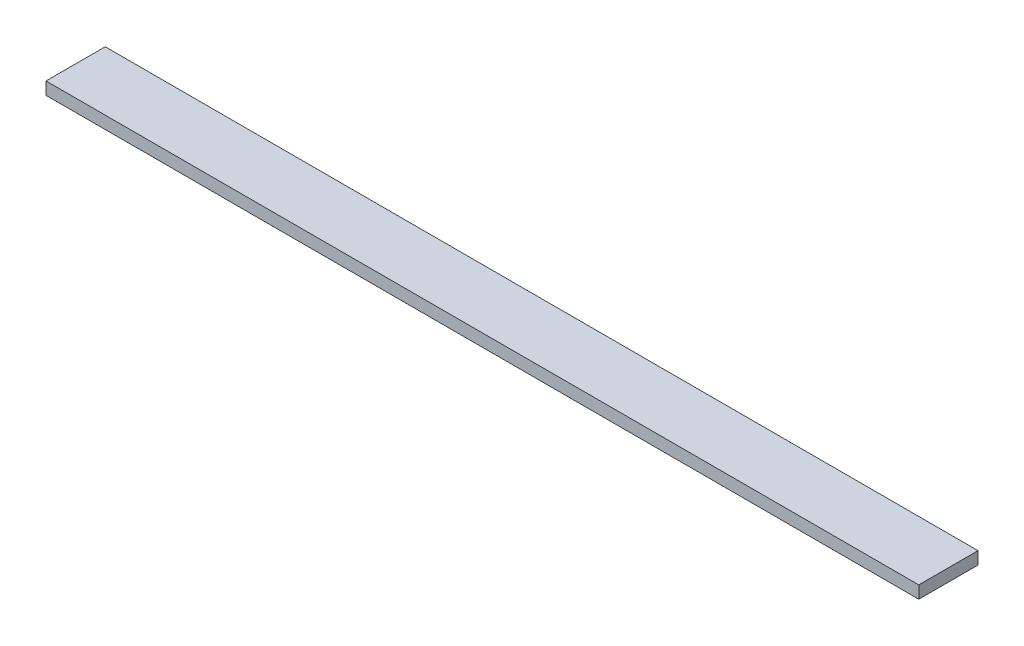
ISO-10303-21;
HEADER;
FILE_DESCRIPTION(('STEP AP214'),'2;1');
FILE_NAME('part.step','',(''),(''),'','','');
FILE_SCHEMA(('AUTOMOTIVE_DESIGN { 1 0 10303 214 1 1 1 1 }'));
ENDSEC;
DATA;
#1=APPLICATION_CONTEXT('core data for automotive mechanical design processes');
#2=APPLICATION_PROTOCOL_DEFINITION('international standard','automotive_design',2000,#1);
#3=PRODUCT_CONTEXT('',#1,'mechanical');
#4=PRODUCT('Part','Part','',(#3));
#5=PRODUCT_RELATED_PRODUCT_CATEGORY('part','',(#4));
#6=PRODUCT_DEFINITION_FORMATION('','',#4);
#7=PRODUCT_DEFINITION_CONTEXT('part definition',#1,'design');
#8=PRODUCT_DEFINITION('design','',#6,#7);
#9=PRODUCT_DEFINITION_SHAPE('','',#8);
#10=(LENGTH_UNIT() NAMED_UNIT(*) SI_UNIT(.MILLI.,.METRE.));
#11=(NAMED_UNIT(*) PLANE_ANGLE_UNIT() SI_UNIT($,.RADIAN.));
#12=(NAMED_UNIT(*) SI_UNIT($,.STERADIAN.) SOLID_ANGLE_UNIT());
#13=UNCERTAINTY_MEASURE_WITH_UNIT(LENGTH_MEASURE(1.E-05),#10,'distance_accuracy_value','');
#14=(GEOMETRIC_REPRESENTATION_CONTEXT(3) GLOBAL_UNCERTAINTY_ASSIGNED_CONTEXT((#13)) GLOBAL_UNIT_ASSIGNED_CONTEXT((#10,
#11,#12)) REPRESENTATION_CONTEXT('',''));
#15=CARTESIAN_POINT('',(0.,0.,0.));
#16=DIRECTION('',(0.,0.,1.));
#17=DIRECTION('',(1.,0.,0.));
#18=AXIS2_PLACEMENT_3D('',#15,#16,#17);
#19=CARTESIAN_POINT('',(0.,2.54,0.));
#20=DIRECTION('',(1.,0.,0.));
#21=DIRECTION('',(0.,0.,-1.));
#22=AXIS2_PLACEMENT_3D('',#19,#20,#21);
#23=PLANE('',#22);
#24=DIRECTION('',(0.,0.,1.));
#25=VECTOR('',#24,1.);
#26=CARTESIAN_POINT('',(0.,0.,0.));
#27=LINE('',#26,#25);
#28=CARTESIAN_POINT('',(0.,0.,-12.065));
#29=VERTEX_POINT('',#28);
#30=CARTESIAN_POINT('',(0.,0.,0.));
#31=VERTEX_POINT('',#30);
#32=EDGE_CURVE('E107',#29,#31,#27,.T.);
#33=ORIENTED_EDGE('',*,*,#32,.T.);
#34=DIRECTION('',(0.,-1.,0.));
#35=VECTOR('',#34,1.);
#36=CARTESIAN_POINT('',(0.,2.54,0.));
#37=LINE('',#36,#35);
#38=CARTESIAN_POINT('',(0.,2.54,0.));
#39=VERTEX_POINT('',#38);
#40=EDGE_CURVE('E11',#39,#31,#37,.T.);
#41=ORIENTED_EDGE('',*,*,#40,.F.);
#42=DIRECTION('',(0.,0.,1.));
#43=VECTOR('',#42,1.);
#44=CARTESIAN_POINT('',(0.,2.54,0.));
#45=LINE('',#44,#43);
#46=CARTESIAN_POINT('',(0.,2.54,-12.065));
#47=VERTEX_POINT('',#46);
#48=EDGE_CURVE('E91',#47,#39,#45,.T.);
#49=ORIENTED_EDGE('',*,*,#48,.F.);
#50=DIRECTION('',(0.,-1.,0.));
#51=VECTOR('',#50,1.);
#52=CARTESIAN_POINT('',(0.,2.54,-12.065));
#53=LINE('',#52,#51);
#54=EDGE_CURVE('E103',#47,#29,#53,.T.);
#55=ORIENTED_EDGE('',*,*,#54,.T.);
#56=EDGE_LOOP('',(#33,#41,#49,#55));
#57=FACE_BOUND('',#56,.T.);
#58=ADVANCED_FACE('F39',(#57),#23,.F.);
#59=CARTESIAN_POINT('',(0.,2.54,0.));
#60=DIRECTION('',(0.,0.,-1.));
#61=DIRECTION('',(-1.,0.,0.));
#62=AXIS2_PLACEMENT_3D('',#59,#60,#61);
#63=PLANE('',#62);
#64=DIRECTION('',(1.,0.,0.));
#65=VECTOR('',#64,1.);
#66=CARTESIAN_POINT('',(0.,0.,0.));
#67=LINE('',#66,#65);
#68=CARTESIAN_POINT('',(177.8,0.,0.));
#69=VERTEX_POINT('',#68);
#70=EDGE_CURVE('E96',#31,#69,#67,.T.);
#71=ORIENTED_EDGE('',*,*,#70,.T.);
#72=DIRECTION('',(0.,-1.,0.));
#73=VECTOR('',#72,1.);
#74=CARTESIAN_POINT('',(177.8,2.54,0.));
#75=LINE('',#74,#73);
#76=CARTESIAN_POINT('',(177.8,2.54,0.));
#77=VERTEX_POINT('',#76);
#78=EDGE_CURVE('E48',#77,#69,#75,.T.);
#79=ORIENTED_EDGE('',*,*,#78,.F.);
#80=DIRECTION('',(1.,0.,0.));
#81=VECTOR('',#80,1.);
#82=CARTESIAN_POINT('',(0.,2.54,0.));
#83=LINE('',#82,#81);
#84=EDGE_CURVE('E86',#39,#77,#83,.T.);
#85=ORIENTED_EDGE('',*,*,#84,.F.);
#86=ORIENTED_EDGE('',*,*,#40,.T.);
#87=EDGE_LOOP('',(#71,#79,#85,#86));
#88=FACE_BOUND('',#87,.T.);
#89=ADVANCED_FACE('F95',(#88),#63,.F.);
#90=CARTESIAN_POINT('',(177.8,2.54,0.));
#91=DIRECTION('',(-1.,0.,0.));
#92=DIRECTION('',(0.,0.,1.));
#93=AXIS2_PLACEMENT_3D('',#90,#91,#92);
#94=PLANE('',#93);
#95=DIRECTION('',(0.,0.,-1.));
#96=VECTOR('',#95,1.);
#97=CARTESIAN_POINT('',(177.8,0.,0.));
#98=LINE('',#97,#96);
#99=CARTESIAN_POINT('',(177.8,0.,-12.065));
#100=VERTEX_POINT('',#99);
#101=EDGE_CURVE('E73',#69,#100,#98,.T.);
#102=ORIENTED_EDGE('',*,*,#101,.T.);
#103=DIRECTION('',(0.,-1.,0.));
#104=VECTOR('',#103,1.);
#105=CARTESIAN_POINT('',(177.8,2.54,-12.065));
#106=LINE('',#105,#104);
#107=CARTESIAN_POINT('',(177.8,2.54,-12.065));
#108=VERTEX_POINT('',#107);
#109=EDGE_CURVE('E98',#108,#100,#106,.T.);
#110=ORIENTED_EDGE('',*,*,#109,.F.);
#111=DIRECTION('',(0.,0.,-1.));
#112=VECTOR('',#111,1.);
#113=CARTESIAN_POINT('',(177.8,2.54,0.));
#114=LINE('',#113,#112);
#115=EDGE_CURVE('E89',#77,#108,#114,.T.);
#116=ORIENTED_EDGE('',*,*,#115,.F.);
#117=ORIENTED_EDGE('',*,*,#78,.T.);
#118=EDGE_LOOP('',(#102,#110,#116,#117));
#119=FACE_BOUND('',#118,.T.);
#120=ADVANCED_FACE('F99',(#119),#94,.F.);
#121=CARTESIAN_POINT('',(0.,2.54,-12.065));
#122=DIRECTION('',(0.,0.,1.));
#123=DIRECTION('',(1.,0.,0.));
#124=AXIS2_PLACEMENT_3D('',#121,#122,#123);
#125=PLANE('',#124);
#126=DIRECTION('',(-1.,0.,0.));
#127=VECTOR('',#126,1.);
#128=CARTESIAN_POINT('',(0.,0.,-12.065));
#129=LINE('',#128,#127);
#130=EDGE_CURVE('E79',#100,#29,#129,.T.);
#131=ORIENTED_EDGE('',*,*,#130,.T.);
#132=ORIENTED_EDGE('',*,*,#54,.F.);
#133=DIRECTION('',(-1.,0.,0.));
#134=VECTOR('',#133,1.);
#135=CARTESIAN_POINT('',(0.,2.54,-12.065));
#136=LINE('',#135,#134);
#137=EDGE_CURVE('E56',#108,#47,#136,.T.);
#138=ORIENTED_EDGE('',*,*,#137,.F.);
#139=ORIENTED_EDGE('',*,*,#109,.T.);
#140=EDGE_LOOP('',(#131,#132,#138,#139));
#141=FACE_BOUND('',#140,.T.);
#142=ADVANCED_FACE('F120',(#141),#125,.F.);
#143=CARTESIAN_POINT('',(0.,2.54,0.));
#144=DIRECTION('',(0.,-1.,0.));
#145=DIRECTION('',(0.,0.,-1.));
#146=AXIS2_PLACEMENT_3D('',#143,#144,#145);
#147=PLANE('',#146);
#148=ORIENTED_EDGE('',*,*,#48,.T.);
#149=ORIENTED_EDGE('',*,*,#84,.T.);
#150=ORIENTED_EDGE('',*,*,#115,.T.);
#151=ORIENTED_EDGE('',*,*,#137,.T.);
#152=EDGE_LOOP('',(#148,#149,#150,#151));
#153=FACE_BOUND('',#152,.T.);
#154=ADVANCED_FACE('F87',(#153),#147,.F.);
#155=CARTESIAN_POINT('',(0.,0.,0.));
#156=DIRECTION('',(0.,-1.,0.));
#157=DIRECTION('',(0.,0.,-1.));
#158=AXIS2_PLACEMENT_3D('',#155,#156,#157);
#159=PLANE('',#158);
#160=ORIENTED_EDGE('',*,*,#32,.F.);
#161=ORIENTED_EDGE('',*,*,#130,.F.);
#162=ORIENTED_EDGE('',*,*,#101,.F.);
#163=ORIENTED_EDGE('',*,*,#70,.F.);
#164=EDGE_LOOP('',(#160,#161,#162,#163));
#165=FACE_BOUND('',#164,.T.);
#166=ADVANCED_FACE('F123',(#165),#159,.T.);
#167=CLOSED_SHELL('',(#58,#89,#120,#142,#154,#166));
#168=MANIFOLD_SOLID_BREP('B2',#167);
#169=ADVANCED_BREP_SHAPE_REPRESENTATION('',(#18,#168),#14);
#170=SHAPE_DEFINITION_REPRESENTATION(#9,#169);
ENDSEC;
END-ISO-10303-21;
